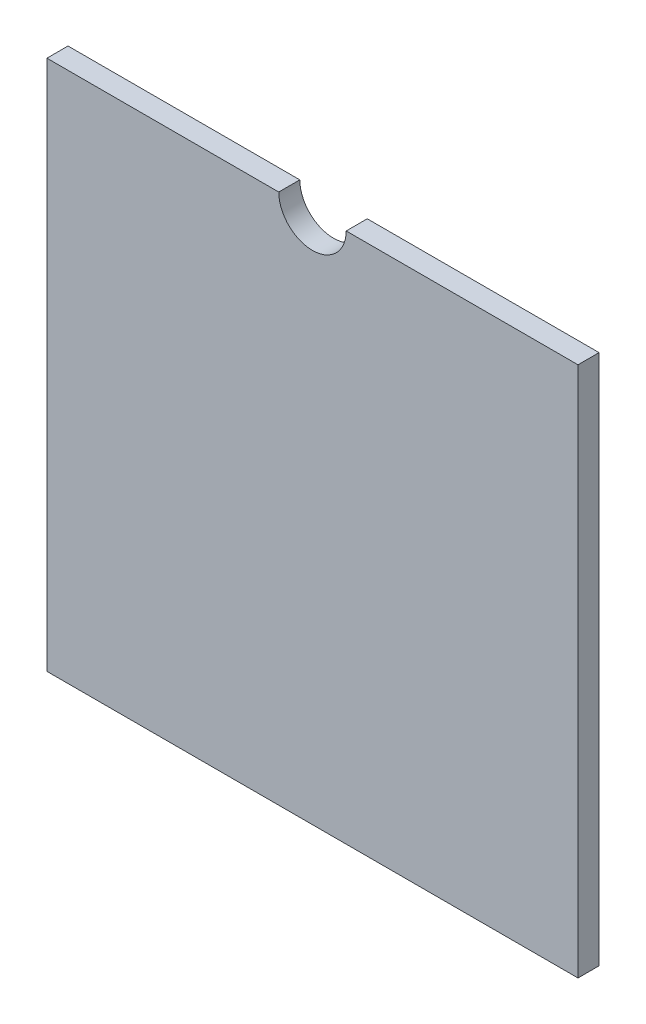
ISO-10303-21;
HEADER;
FILE_DESCRIPTION(('STEP AP214'),'2;1');
FILE_NAME('part.step','',(''),(''),'','','');
FILE_SCHEMA(('AUTOMOTIVE_DESIGN { 1 0 10303 214 1 1 1 1 }'));
ENDSEC;
DATA;
#1=APPLICATION_CONTEXT('core data for automotive mechanical design processes');
#2=APPLICATION_PROTOCOL_DEFINITION('international standard','automotive_design',2000,#1);
#3=PRODUCT_CONTEXT('',#1,'mechanical');
#4=PRODUCT('Part','Part','',(#3));
#5=PRODUCT_RELATED_PRODUCT_CATEGORY('part','',(#4));
#6=PRODUCT_DEFINITION_FORMATION('','',#4);
#7=PRODUCT_DEFINITION_CONTEXT('part definition',#1,'design');
#8=PRODUCT_DEFINITION('design','',#6,#7);
#9=PRODUCT_DEFINITION_SHAPE('','',#8);
#10=(LENGTH_UNIT() NAMED_UNIT(*) SI_UNIT(.MILLI.,.METRE.));
#11=(NAMED_UNIT(*) PLANE_ANGLE_UNIT() SI_UNIT($,.RADIAN.));
#12=(NAMED_UNIT(*) SI_UNIT($,.STERADIAN.) SOLID_ANGLE_UNIT());
#13=UNCERTAINTY_MEASURE_WITH_UNIT(LENGTH_MEASURE(1.E-05),#10,'distance_accuracy_value','');
#14=(GEOMETRIC_REPRESENTATION_CONTEXT(3) GLOBAL_UNCERTAINTY_ASSIGNED_CONTEXT((#13)) GLOBAL_UNIT_ASSIGNED_CONTEXT((#10,
#11,#12)) REPRESENTATION_CONTEXT('',''));
#15=CARTESIAN_POINT('',(0.,0.,0.));
#16=DIRECTION('',(0.,0.,1.));
#17=DIRECTION('',(1.,0.,0.));
#18=AXIS2_PLACEMENT_3D('',#15,#16,#17);
#19=CARTESIAN_POINT('',(0.,0.,7.9375));
#20=DIRECTION('',(1.,0.,0.));
#21=DIRECTION('',(0.,0.,-1.));
#22=AXIS2_PLACEMENT_3D('',#19,#20,#21);
#23=PLANE('',#22);
#24=DIRECTION('',(0.,-1.,0.));
#25=VECTOR('',#24,1.);
#26=CARTESIAN_POINT('',(0.,0.,0.));
#27=LINE('',#26,#25);
#28=CARTESIAN_POINT('',(0.,199.9996,0.));
#29=VERTEX_POINT('',#28);
#30=CARTESIAN_POINT('',(0.,0.,0.));
#31=VERTEX_POINT('',#30);
#32=EDGE_CURVE('E128',#29,#31,#27,.T.);
#33=ORIENTED_EDGE('',*,*,#32,.T.);
#34=DIRECTION('',(0.,0.,-1.));
#35=VECTOR('',#34,1.);
#36=CARTESIAN_POINT('',(0.,0.,7.9375));
#37=LINE('',#36,#35);
#38=CARTESIAN_POINT('',(0.,0.,7.9375));
#39=VERTEX_POINT('',#38);
#40=EDGE_CURVE('E11',#39,#31,#37,.T.);
#41=ORIENTED_EDGE('',*,*,#40,.F.);
#42=DIRECTION('',(0.,-1.,0.));
#43=VECTOR('',#42,1.);
#44=CARTESIAN_POINT('',(0.,0.,7.9375));
#45=LINE('',#44,#43);
#46=CARTESIAN_POINT('',(0.,199.9996,7.9375));
#47=VERTEX_POINT('',#46);
#48=EDGE_CURVE('E144',#47,#39,#45,.T.);
#49=ORIENTED_EDGE('',*,*,#48,.F.);
#50=DIRECTION('',(0.,0.,-1.));
#51=VECTOR('',#50,1.);
#52=CARTESIAN_POINT('',(0.,199.9996,7.9375));
#53=LINE('',#52,#51);
#54=EDGE_CURVE('E124',#47,#29,#53,.T.);
#55=ORIENTED_EDGE('',*,*,#54,.T.);
#56=EDGE_LOOP('',(#33,#41,#49,#55));
#57=FACE_BOUND('',#56,.T.);
#58=ADVANCED_FACE('F39',(#57),#23,.F.);
#59=CARTESIAN_POINT('',(0.,0.,7.9375));
#60=DIRECTION('',(0.,1.,0.));
#61=DIRECTION('',(0.,0.,1.));
#62=AXIS2_PLACEMENT_3D('',#59,#60,#61);
#63=PLANE('',#62);
#64=DIRECTION('',(1.,0.,0.));
#65=VECTOR('',#64,1.);
#66=CARTESIAN_POINT('',(0.,0.,0.));
#67=LINE('',#66,#65);
#68=CARTESIAN_POINT('',(199.9996,0.,0.));
#69=VERTEX_POINT('',#68);
#70=EDGE_CURVE('E132',#31,#69,#67,.T.);
#71=ORIENTED_EDGE('',*,*,#70,.T.);
#72=DIRECTION('',(0.,0.,-1.));
#73=VECTOR('',#72,1.);
#74=CARTESIAN_POINT('',(199.9996,0.,7.9375));
#75=LINE('',#74,#73);
#76=CARTESIAN_POINT('',(199.9996,0.,7.9375));
#77=VERTEX_POINT('',#76);
#78=EDGE_CURVE('E48',#77,#69,#75,.T.);
#79=ORIENTED_EDGE('',*,*,#78,.F.);
#80=DIRECTION('',(1.,0.,0.));
#81=VECTOR('',#80,1.);
#82=CARTESIAN_POINT('',(0.,0.,7.9375));
#83=LINE('',#82,#81);
#84=EDGE_CURVE('E93',#39,#77,#83,.T.);
#85=ORIENTED_EDGE('',*,*,#84,.F.);
#86=ORIENTED_EDGE('',*,*,#40,.T.);
#87=EDGE_LOOP('',(#71,#79,#85,#86));
#88=FACE_BOUND('',#87,.T.);
#89=ADVANCED_FACE('F172',(#88),#63,.F.);
#90=CARTESIAN_POINT('',(199.9996,0.,7.9375));
#91=DIRECTION('',(-1.,0.,0.));
#92=DIRECTION('',(0.,0.,1.));
#93=AXIS2_PLACEMENT_3D('',#90,#91,#92);
#94=PLANE('',#93);
#95=DIRECTION('',(0.,1.,0.));
#96=VECTOR('',#95,1.);
#97=CARTESIAN_POINT('',(199.9996,0.,0.));
#98=LINE('',#97,#96);
#99=CARTESIAN_POINT('',(199.9996,199.9996,0.));
#100=VERTEX_POINT('',#99);
#101=EDGE_CURVE('E135',#69,#100,#98,.T.);
#102=ORIENTED_EDGE('',*,*,#101,.T.);
#103=DIRECTION('',(0.,0.,-1.));
#104=VECTOR('',#103,1.);
#105=CARTESIAN_POINT('',(199.9996,199.9996,7.9375));
#106=LINE('',#105,#104);
#107=CARTESIAN_POINT('',(199.9996,199.9996,7.9375));
#108=VERTEX_POINT('',#107);
#109=EDGE_CURVE('E117',#108,#100,#106,.T.);
#110=ORIENTED_EDGE('',*,*,#109,.F.);
#111=DIRECTION('',(0.,1.,0.));
#112=VECTOR('',#111,1.);
#113=CARTESIAN_POINT('',(199.9996,0.,7.9375));
#114=LINE('',#113,#112);
#115=EDGE_CURVE('E106',#77,#108,#114,.T.);
#116=ORIENTED_EDGE('',*,*,#115,.F.);
#117=ORIENTED_EDGE('',*,*,#78,.T.);
#118=EDGE_LOOP('',(#102,#110,#116,#117));
#119=FACE_BOUND('',#118,.T.);
#120=ADVANCED_FACE('F154',(#119),#94,.F.);
#121=CARTESIAN_POINT('',(112.6998,199.9996,7.9375));
#122=DIRECTION('',(0.,-1.,0.));
#123=DIRECTION('',(1.,0.,0.));
#124=AXIS2_PLACEMENT_3D('',#121,#122,#123);
#125=PLANE('',#124);
#126=DIRECTION('',(-1.,0.,0.));
#127=VECTOR('',#126,1.);
#128=CARTESIAN_POINT('',(112.6998,199.9996,0.));
#129=LINE('',#128,#127);
#130=CARTESIAN_POINT('',(112.6998,199.9996,0.));
#131=VERTEX_POINT('',#130);
#132=EDGE_CURVE('E115',#100,#131,#129,.T.);
#133=ORIENTED_EDGE('',*,*,#132,.T.);
#134=DIRECTION('',(0.,0.,-1.));
#135=VECTOR('',#134,1.);
#136=CARTESIAN_POINT('',(112.6998,199.9996,7.9375));
#137=LINE('',#136,#135);
#138=CARTESIAN_POINT('',(112.6998,199.9996,7.9375));
#139=VERTEX_POINT('',#138);
#140=EDGE_CURVE('E112',#139,#131,#137,.T.);
#141=ORIENTED_EDGE('',*,*,#140,.F.);
#142=DIRECTION('',(-1.,0.,0.));
#143=VECTOR('',#142,1.);
#144=CARTESIAN_POINT('',(112.6998,199.9996,7.9375));
#145=LINE('',#144,#143);
#146=EDGE_CURVE('E100',#108,#139,#145,.T.);
#147=ORIENTED_EDGE('',*,*,#146,.F.);
#148=ORIENTED_EDGE('',*,*,#109,.T.);
#149=EDGE_LOOP('',(#133,#141,#147,#148));
#150=FACE_BOUND('',#149,.T.);
#151=ADVANCED_FACE('F113',(#150),#125,.F.);
#152=CARTESIAN_POINT('',(99.9998,199.9996,7.9375));
#153=DIRECTION('',(0.,0.,-1.));
#154=DIRECTION('',(-1.,0.,0.));
#155=AXIS2_PLACEMENT_3D('',#152,#153,#154);
#156=CYLINDRICAL_SURFACE('',#155,12.7);
#157=CARTESIAN_POINT('',(99.9998,199.9996,0.));
#158=DIRECTION('',(0.,0.,-1.));
#159=DIRECTION('',(1.,0.,0.));
#160=AXIS2_PLACEMENT_3D('',#157,#158,#159);
#161=CIRCLE('',#160,12.7);
#162=CARTESIAN_POINT('',(87.2998,199.9996,0.));
#163=VERTEX_POINT('',#162);
#164=EDGE_CURVE('E79',#131,#163,#161,.T.);
#165=ORIENTED_EDGE('',*,*,#164,.T.);
#166=DIRECTION('',(0.,0.,-1.));
#167=VECTOR('',#166,1.);
#168=CARTESIAN_POINT('',(87.2998,199.9996,7.9375));
#169=LINE('',#168,#167);
#170=CARTESIAN_POINT('',(87.2998,199.9996,7.9375));
#171=VERTEX_POINT('',#170);
#172=EDGE_CURVE('E118',#171,#163,#169,.T.);
#173=ORIENTED_EDGE('',*,*,#172,.F.);
#174=CARTESIAN_POINT('',(99.9998,199.9996,7.9375));
#175=DIRECTION('',(0.,0.,-1.));
#176=DIRECTION('',(1.,0.,0.));
#177=AXIS2_PLACEMENT_3D('',#174,#175,#176);
#178=CIRCLE('',#177,12.7);
#179=EDGE_CURVE('E104',#139,#171,#178,.T.);
#180=ORIENTED_EDGE('',*,*,#179,.F.);
#181=ORIENTED_EDGE('',*,*,#140,.T.);
#182=EDGE_LOOP('',(#165,#173,#180,#181));
#183=FACE_BOUND('',#182,.T.);
#184=ADVANCED_FACE('F120',(#183),#156,.F.);
#185=CARTESIAN_POINT('',(0.,199.9996,7.9375));
#186=DIRECTION('',(0.,-1.,0.));
#187=DIRECTION('',(1.,0.,0.));
#188=AXIS2_PLACEMENT_3D('',#185,#186,#187);
#189=PLANE('',#188);
#190=DIRECTION('',(-1.,0.,0.));
#191=VECTOR('',#190,1.);
#192=CARTESIAN_POINT('',(0.,199.9996,0.));
#193=LINE('',#192,#191);
#194=EDGE_CURVE('E85',#163,#29,#193,.T.);
#195=ORIENTED_EDGE('',*,*,#194,.T.);
#196=ORIENTED_EDGE('',*,*,#54,.F.);
#197=DIRECTION('',(-1.,0.,0.));
#198=VECTOR('',#197,1.);
#199=CARTESIAN_POINT('',(0.,199.9996,7.9375));
#200=LINE('',#199,#198);
#201=EDGE_CURVE('E56',#171,#47,#200,.T.);
#202=ORIENTED_EDGE('',*,*,#201,.F.);
#203=ORIENTED_EDGE('',*,*,#172,.T.);
#204=EDGE_LOOP('',(#195,#196,#202,#203));
#205=FACE_BOUND('',#204,.T.);
#206=ADVANCED_FACE('F161',(#205),#189,.F.);
#207=CARTESIAN_POINT('',(99.9998,199.9996,7.9375));
#208=DIRECTION('',(0.,0.,1.));
#209=DIRECTION('',(1.,0.,0.));
#210=AXIS2_PLACEMENT_3D('',#207,#208,#209);
#211=PLANE('',#210);
#212=ORIENTED_EDGE('',*,*,#48,.T.);
#213=ORIENTED_EDGE('',*,*,#84,.T.);
#214=ORIENTED_EDGE('',*,*,#115,.T.);
#215=ORIENTED_EDGE('',*,*,#146,.T.);
#216=ORIENTED_EDGE('',*,*,#179,.T.);
#217=ORIENTED_EDGE('',*,*,#201,.T.);
#218=EDGE_LOOP('',(#212,#213,#214,#215,#216,#217));
#219=FACE_BOUND('',#218,.T.);
#220=ADVANCED_FACE('F102',(#219),#211,.T.);
#221=CARTESIAN_POINT('',(99.9998,199.9996,0.));
#222=DIRECTION('',(0.,0.,1.));
#223=DIRECTION('',(1.,0.,0.));
#224=AXIS2_PLACEMENT_3D('',#221,#222,#223);
#225=PLANE('',#224);
#226=ORIENTED_EDGE('',*,*,#32,.F.);
#227=ORIENTED_EDGE('',*,*,#194,.F.);
#228=ORIENTED_EDGE('',*,*,#164,.F.);
#229=ORIENTED_EDGE('',*,*,#132,.F.);
#230=ORIENTED_EDGE('',*,*,#101,.F.);
#231=ORIENTED_EDGE('',*,*,#70,.F.);
#232=EDGE_LOOP('',(#226,#227,#228,#229,#230,#231));
#233=FACE_BOUND('',#232,.T.);
#234=ADVANCED_FACE('F157',(#233),#225,.F.);
#235=CLOSED_SHELL('',(#58,#89,#120,#151,#184,#206,#220,#234));
#236=MANIFOLD_SOLID_BREP('B2',#235);
#237=ADVANCED_BREP_SHAPE_REPRESENTATION('',(#18,#236),#14);
#238=SHAPE_DEFINITION_REPRESENTATION(#9,#237);
ENDSEC;
END-ISO-10303-21;
